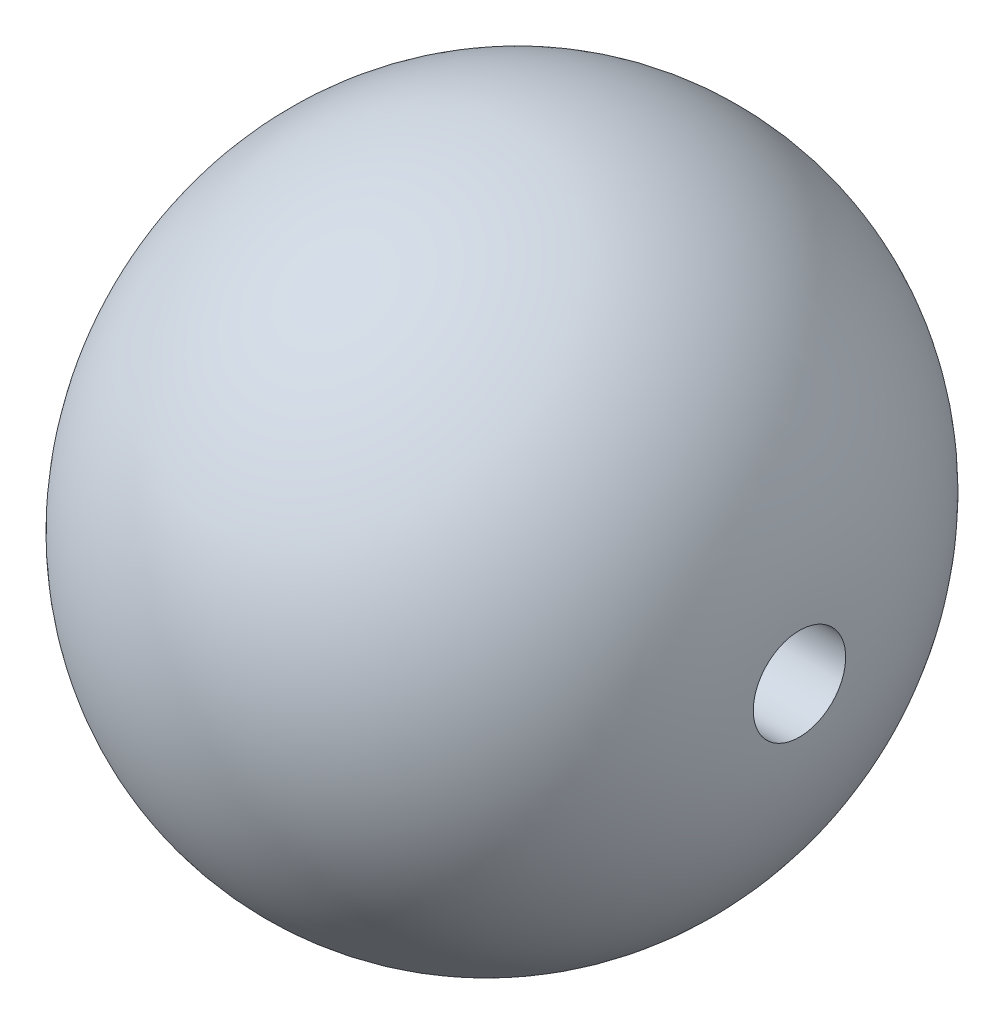
ISO-10303-21;
HEADER;
FILE_DESCRIPTION(('STEP AP214'),'2;1');
FILE_NAME('part.step','',(''),(''),'','','');
FILE_SCHEMA(('AUTOMOTIVE_DESIGN { 1 0 10303 214 1 1 1 1 }'));
ENDSEC;
DATA;
#1=APPLICATION_CONTEXT('core data for automotive mechanical design processes');
#2=APPLICATION_PROTOCOL_DEFINITION('international standard','automotive_design',2000,#1);
#3=PRODUCT_CONTEXT('',#1,'mechanical');
#4=PRODUCT('Part','Part','',(#3));
#5=PRODUCT_RELATED_PRODUCT_CATEGORY('part','',(#4));
#6=PRODUCT_DEFINITION_FORMATION('','',#4);
#7=PRODUCT_DEFINITION_CONTEXT('part definition',#1,'design');
#8=PRODUCT_DEFINITION('design','',#6,#7);
#9=PRODUCT_DEFINITION_SHAPE('','',#8);
#10=(LENGTH_UNIT() NAMED_UNIT(*) SI_UNIT(.MILLI.,.METRE.));
#11=(NAMED_UNIT(*) PLANE_ANGLE_UNIT() SI_UNIT($,.RADIAN.));
#12=(NAMED_UNIT(*) SI_UNIT($,.STERADIAN.) SOLID_ANGLE_UNIT());
#13=UNCERTAINTY_MEASURE_WITH_UNIT(LENGTH_MEASURE(1.E-05),#10,'distance_accuracy_value','');
#14=(GEOMETRIC_REPRESENTATION_CONTEXT(3) GLOBAL_UNCERTAINTY_ASSIGNED_CONTEXT((#13)) GLOBAL_UNIT_ASSIGNED_CONTEXT((#10,
#11,#12)) REPRESENTATION_CONTEXT('',''));
#15=CARTESIAN_POINT('',(0.,0.,0.));
#16=DIRECTION('',(0.,0.,1.));
#17=DIRECTION('',(1.,0.,0.));
#18=AXIS2_PLACEMENT_3D('',#15,#16,#17);
#19=CARTESIAN_POINT('',(0.,0.,0.));
#20=DIRECTION('',(-1.,0.,0.));
#21=DIRECTION('',(0.,0.,1.));
#22=AXIS2_PLACEMENT_3D('',#19,#20,#21);
#23=DEGENERATE_TOROIDAL_SURFACE('',#22,1.88888888888889,16.1111111111111,.T.);
#24=CARTESIAN_POINT('',(16.0995169009646,0.,0.));
#25=DIRECTION('',(-1.,0.,0.));
#26=DIRECTION('',(0.,0.,1.));
#27=AXIS2_PLACEMENT_3D('',#24,#25,#26);
#28=CIRCLE('',#27,2.5);
#29=CARTESIAN_POINT('',(16.0995169009646,0.,2.5));
#30=VERTEX_POINT('',#29);
#31=EDGE_CURVE('E51',#30,#30,#28,.F.);
#32=ORIENTED_EDGE('',*,*,#31,.F.);
#33=EDGE_LOOP('',(#32));
#34=FACE_BOUND('',#33,.T.);
#35=CARTESIAN_POINT('',(-16.0995169009646,0.,0.));
#36=DIRECTION('',(1.,0.,0.));
#37=DIRECTION('',(0.,0.,-1.));
#38=AXIS2_PLACEMENT_3D('',#35,#36,#37);
#39=CIRCLE('',#38,2.5);
#40=CARTESIAN_POINT('',(-16.0995169009646,0.,-2.5));
#41=VERTEX_POINT('',#40);
#42=EDGE_CURVE('E10',#41,#41,#39,.F.);
#43=ORIENTED_EDGE('',*,*,#42,.F.);
#44=EDGE_LOOP('',(#43));
#45=FACE_BOUND('',#44,.T.);
#46=ADVANCED_FACE('F43',(#34,#45),#23,.T.);
#47=CARTESIAN_POINT('',(27.,0.,0.));
#48=DIRECTION('',(-1.,0.,0.));
#49=DIRECTION('',(0.,0.,1.));
#50=AXIS2_PLACEMENT_3D('',#47,#48,#49);
#51=CYLINDRICAL_SURFACE('',#50,2.5);
#52=ORIENTED_EDGE('',*,*,#31,.T.);
#53=EDGE_LOOP('',(#52));
#54=FACE_BOUND('',#53,.T.);
#55=ORIENTED_EDGE('',*,*,#42,.T.);
#56=EDGE_LOOP('',(#55));
#57=FACE_BOUND('',#56,.T.);
#58=ADVANCED_FACE('F58',(#54,#57),#51,.F.);
#59=CLOSED_SHELL('',(#46,#58));
#60=MANIFOLD_SOLID_BREP('B2',#59);
#61=ADVANCED_BREP_SHAPE_REPRESENTATION('',(#18,#60),#14);
#62=SHAPE_DEFINITION_REPRESENTATION(#9,#61);
ENDSEC;
END-ISO-10303-21;
